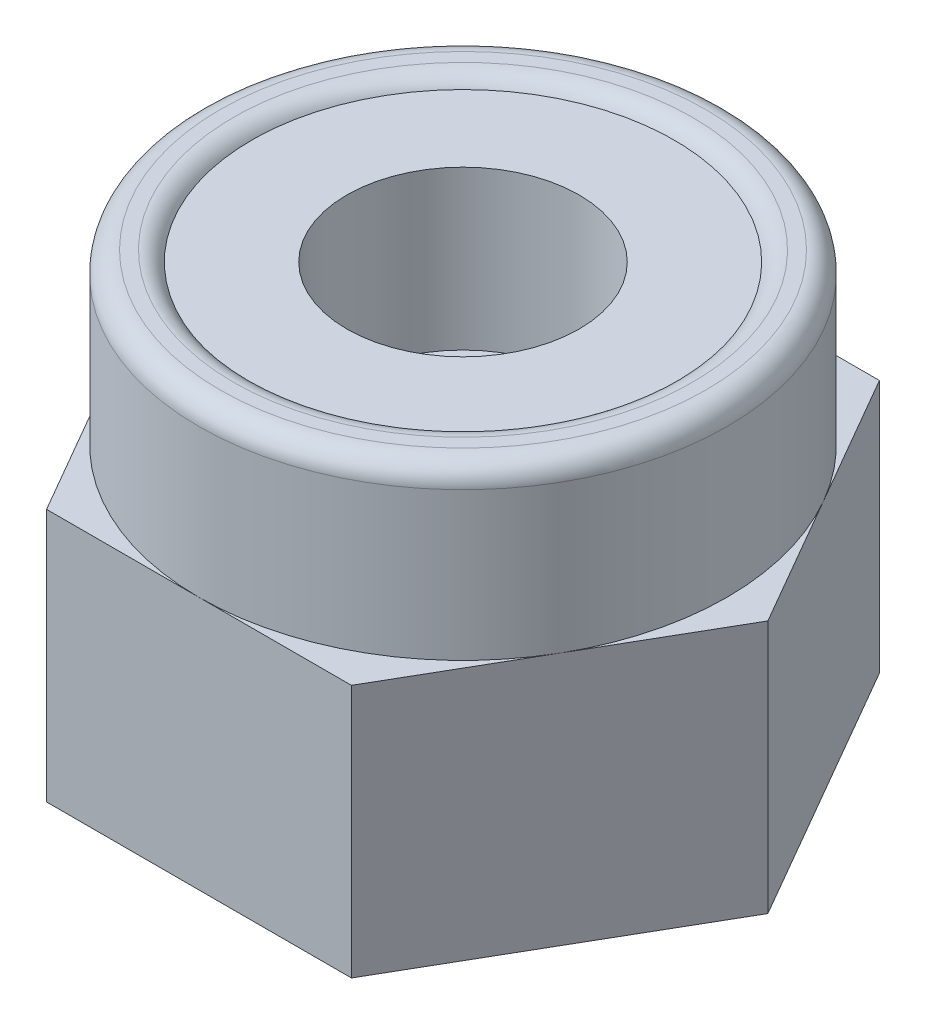
ISO-10303-21;
HEADER;
FILE_DESCRIPTION(('STEP AP214'),'2;1');
FILE_NAME('part.step','',(''),(''),'','','');
FILE_SCHEMA(('AUTOMOTIVE_DESIGN { 1 0 10303 214 1 1 1 1 }'));
ENDSEC;
DATA;
#1=APPLICATION_CONTEXT('core data for automotive mechanical design processes');
#2=APPLICATION_PROTOCOL_DEFINITION('international standard','automotive_design',2000,#1);
#3=PRODUCT_CONTEXT('',#1,'mechanical');
#4=PRODUCT('Part','Part','',(#3));
#5=PRODUCT_RELATED_PRODUCT_CATEGORY('part','',(#4));
#6=PRODUCT_DEFINITION_FORMATION('','',#4);
#7=PRODUCT_DEFINITION_CONTEXT('part definition',#1,'design');
#8=PRODUCT_DEFINITION('design','',#6,#7);
#9=PRODUCT_DEFINITION_SHAPE('','',#8);
#10=(LENGTH_UNIT() NAMED_UNIT(*) SI_UNIT(.MILLI.,.METRE.));
#11=(NAMED_UNIT(*) PLANE_ANGLE_UNIT() SI_UNIT($,.RADIAN.));
#12=(NAMED_UNIT(*) SI_UNIT($,.STERADIAN.) SOLID_ANGLE_UNIT());
#13=UNCERTAINTY_MEASURE_WITH_UNIT(LENGTH_MEASURE(1.E-05),#10,'distance_accuracy_value','');
#14=(GEOMETRIC_REPRESENTATION_CONTEXT(3) GLOBAL_UNCERTAINTY_ASSIGNED_CONTEXT((#13)) GLOBAL_UNIT_ASSIGNED_CONTEXT((#10,
#11,#12)) REPRESENTATION_CONTEXT('',''));
#15=CARTESIAN_POINT('',(0.,0.,0.));
#16=DIRECTION('',(0.,0.,1.));
#17=DIRECTION('',(1.,0.,0.));
#18=AXIS2_PLACEMENT_3D('',#15,#16,#17);
#19=CARTESIAN_POINT('',(0.,4.,0.));
#20=DIRECTION('',(0.,-1.,0.));
#21=DIRECTION('',(0.,0.,-1.));
#22=AXIS2_PLACEMENT_3D('',#19,#20,#21);
#23=CYLINDRICAL_SURFACE('',#22,1.1);
#24=CARTESIAN_POINT('',(0.,2.4,0.));
#25=DIRECTION('',(0.,1.,0.));
#26=DIRECTION('',(0.,0.,1.));
#27=AXIS2_PLACEMENT_3D('',#24,#25,#26);
#28=CIRCLE('',#27,1.1);
#29=CARTESIAN_POINT('',(0.,2.4,1.1));
#30=VERTEX_POINT('',#29);
#31=EDGE_CURVE('E145',#30,#30,#28,.T.);
#32=ORIENTED_EDGE('',*,*,#31,.F.);
#33=EDGE_LOOP('',(#32));
#34=FACE_BOUND('',#33,.T.);
#35=CARTESIAN_POINT('',(0.,3.9,0.));
#36=DIRECTION('',(0.,1.,0.));
#37=DIRECTION('',(0.,0.,1.));
#38=AXIS2_PLACEMENT_3D('',#35,#36,#37);
#39=CIRCLE('',#38,1.1);
#40=CARTESIAN_POINT('',(0.,3.9,1.1));
#41=VERTEX_POINT('',#40);
#42=EDGE_CURVE('E327',#41,#41,#39,.T.);
#43=ORIENTED_EDGE('',*,*,#42,.T.);
#44=EDGE_LOOP('',(#43));
#45=FACE_BOUND('',#44,.T.);
#46=ADVANCED_FACE('F40',(#34,#45),#23,.F.);
#47=CARTESIAN_POINT('',(-1.44337567297406,2.4,-2.5));
#48=DIRECTION('',(0.,1.,0.));
#49=DIRECTION('',(0.,0.,1.));
#50=AXIS2_PLACEMENT_3D('',#47,#48,#49);
#51=PLANE('',#50);
#52=CARTESIAN_POINT('',(0.,2.4,0.));
#53=DIRECTION('',(0.,1.,0.));
#54=DIRECTION('',(0.,0.,1.));
#55=AXIS2_PLACEMENT_3D('',#52,#53,#54);
#56=CIRCLE('',#55,2.5);
#57=CARTESIAN_POINT('',(0.,2.4,2.5));
#58=VERTEX_POINT('',#57);
#59=CARTESIAN_POINT('',(2.1650635094611,2.4,1.25));
#60=VERTEX_POINT('',#59);
#61=EDGE_CURVE('E140',#58,#60,#56,.T.);
#62=ORIENTED_EDGE('',*,*,#61,.F.);
#63=DIRECTION('',(1.,0.,0.));
#64=VECTOR('',#63,1.);
#65=CARTESIAN_POINT('',(-1.44337567297407,2.4,2.5));
#66=LINE('',#65,#64);
#67=CARTESIAN_POINT('',(1.44337567297406,2.4,2.5));
#68=VERTEX_POINT('',#67);
#69=EDGE_CURVE('E128',#58,#68,#66,.T.);
#70=ORIENTED_EDGE('',*,*,#69,.T.);
#71=DIRECTION('',(0.5,0.,-0.866025403784439));
#72=VECTOR('',#71,1.);
#73=CARTESIAN_POINT('',(1.44337567297406,2.4,2.5));
#74=LINE('',#73,#72);
#75=EDGE_CURVE('E142',#68,#60,#74,.T.);
#76=ORIENTED_EDGE('',*,*,#75,.T.);
#77=EDGE_LOOP('',(#62,#70,#76));
#78=FACE_BOUND('',#77,.T.);
#79=ADVANCED_FACE('F141',(#78),#51,.T.);
#80=CARTESIAN_POINT('',(2.1650635094611,2.4,-1.25));
#81=VERTEX_POINT('',#80);
#82=EDGE_CURVE('E63',#60,#81,#56,.T.);
#83=ORIENTED_EDGE('',*,*,#82,.F.);
#84=CARTESIAN_POINT('',(2.88675134594813,2.4,0.));
#85=VERTEX_POINT('',#84);
#86=EDGE_CURVE('E127',#60,#85,#74,.T.);
#87=ORIENTED_EDGE('',*,*,#86,.T.);
#88=DIRECTION('',(-0.5,0.,-0.866025403784439));
#89=VECTOR('',#88,1.);
#90=CARTESIAN_POINT('',(2.88675134594813,2.4,0.));
#91=LINE('',#90,#89);
#92=EDGE_CURVE('E180',#85,#81,#91,.T.);
#93=ORIENTED_EDGE('',*,*,#92,.T.);
#94=EDGE_LOOP('',(#83,#87,#93));
#95=FACE_BOUND('',#94,.T.);
#96=ADVANCED_FACE('F240',(#95),#51,.T.);
#97=CARTESIAN_POINT('',(0.,2.4,-2.5));
#98=VERTEX_POINT('',#97);
#99=EDGE_CURVE('E55',#81,#98,#56,.T.);
#100=ORIENTED_EDGE('',*,*,#99,.F.);
#101=CARTESIAN_POINT('',(1.44337567297407,2.4,-2.5));
#102=VERTEX_POINT('',#101);
#103=EDGE_CURVE('E179',#81,#102,#91,.T.);
#104=ORIENTED_EDGE('',*,*,#103,.T.);
#105=DIRECTION('',(-1.,0.,0.));
#106=VECTOR('',#105,1.);
#107=CARTESIAN_POINT('',(1.44337567297407,2.4,-2.5));
#108=LINE('',#107,#106);
#109=EDGE_CURVE('E168',#102,#98,#108,.T.);
#110=ORIENTED_EDGE('',*,*,#109,.T.);
#111=EDGE_LOOP('',(#100,#104,#110));
#112=FACE_BOUND('',#111,.T.);
#113=ADVANCED_FACE('F306',(#112),#51,.T.);
#114=CARTESIAN_POINT('',(-2.1650635094611,2.4,-1.25));
#115=VERTEX_POINT('',#114);
#116=EDGE_CURVE('E153',#98,#115,#56,.T.);
#117=ORIENTED_EDGE('',*,*,#116,.F.);
#118=CARTESIAN_POINT('',(-1.44337567297406,2.4,-2.5));
#119=VERTEX_POINT('',#118);
#120=EDGE_CURVE('E171',#98,#119,#108,.T.);
#121=ORIENTED_EDGE('',*,*,#120,.T.);
#122=DIRECTION('',(-0.5,0.,0.866025403784439));
#123=VECTOR('',#122,1.);
#124=CARTESIAN_POINT('',(-1.44337567297406,2.4,-2.5));
#125=LINE('',#124,#123);
#126=EDGE_CURVE('E172',#119,#115,#125,.T.);
#127=ORIENTED_EDGE('',*,*,#126,.T.);
#128=EDGE_LOOP('',(#117,#121,#127));
#129=FACE_BOUND('',#128,.T.);
#130=ADVANCED_FACE('F296',(#129),#51,.T.);
#131=CARTESIAN_POINT('',(-2.1650635094611,2.4,1.25));
#132=VERTEX_POINT('',#131);
#133=EDGE_CURVE('E150',#115,#132,#56,.T.);
#134=ORIENTED_EDGE('',*,*,#133,.F.);
#135=CARTESIAN_POINT('',(-2.88675134594813,2.4,0.));
#136=VERTEX_POINT('',#135);
#137=EDGE_CURVE('E170',#115,#136,#125,.T.);
#138=ORIENTED_EDGE('',*,*,#137,.T.);
#139=DIRECTION('',(0.5,0.,0.866025403784439));
#140=VECTOR('',#139,1.);
#141=CARTESIAN_POINT('',(-2.88675134594813,2.4,0.));
#142=LINE('',#141,#140);
#143=EDGE_CURVE('E138',#136,#132,#142,.T.);
#144=ORIENTED_EDGE('',*,*,#143,.T.);
#145=EDGE_LOOP('',(#134,#138,#144));
#146=FACE_BOUND('',#145,.T.);
#147=ADVANCED_FACE('F301',(#146),#51,.T.);
#148=CARTESIAN_POINT('',(0.,2.4,0.));
#149=DIRECTION('',(0.,1.,0.));
#150=DIRECTION('',(0.,0.,1.));
#151=AXIS2_PLACEMENT_3D('',#148,#149,#150);
#152=CIRCLE('',#151,1.);
#153=CARTESIAN_POINT('',(0.,2.4,1.));
#154=VERTEX_POINT('',#153);
#155=EDGE_CURVE('E161',#154,#154,#152,.T.);
#156=ORIENTED_EDGE('',*,*,#155,.F.);
#157=EDGE_LOOP('',(#156));
#158=FACE_BOUND('',#157,.T.);
#159=ORIENTED_EDGE('',*,*,#31,.T.);
#160=EDGE_LOOP('',(#159));
#161=FACE_BOUND('',#160,.T.);
#162=ADVANCED_FACE('F257',(#158,#161),#51,.T.);
#163=EDGE_CURVE('E121',#132,#58,#56,.T.);
#164=ORIENTED_EDGE('',*,*,#163,.F.);
#165=CARTESIAN_POINT('',(-1.44337567297407,2.4,2.5));
#166=VERTEX_POINT('',#165);
#167=EDGE_CURVE('E123',#132,#166,#142,.T.);
#168=ORIENTED_EDGE('',*,*,#167,.T.);
#169=EDGE_CURVE('E117',#166,#58,#66,.T.);
#170=ORIENTED_EDGE('',*,*,#169,.T.);
#171=EDGE_LOOP('',(#164,#168,#170));
#172=FACE_BOUND('',#171,.T.);
#173=ADVANCED_FACE('F119',(#172),#51,.T.);
#174=CARTESIAN_POINT('',(-1.44337567297406,0.,-2.5));
#175=DIRECTION('',(0.,1.,0.));
#176=DIRECTION('',(0.,0.,1.));
#177=AXIS2_PLACEMENT_3D('',#174,#175,#176);
#178=PLANE('',#177);
#179=DIRECTION('',(-1.,0.,0.));
#180=VECTOR('',#179,1.);
#181=CARTESIAN_POINT('',(1.44337567297407,0.,-2.5));
#182=LINE('',#181,#180);
#183=CARTESIAN_POINT('',(1.44337567297407,0.,-2.5));
#184=VERTEX_POINT('',#183);
#185=CARTESIAN_POINT('',(-1.44337567297406,0.,-2.5));
#186=VERTEX_POINT('',#185);
#187=EDGE_CURVE('E164',#184,#186,#182,.T.);
#188=ORIENTED_EDGE('',*,*,#187,.F.);
#189=DIRECTION('',(-0.5,0.,-0.866025403784439));
#190=VECTOR('',#189,1.);
#191=CARTESIAN_POINT('',(2.88675134594813,0.,0.));
#192=LINE('',#191,#190);
#193=CARTESIAN_POINT('',(2.88675134594813,0.,0.));
#194=VERTEX_POINT('',#193);
#195=EDGE_CURVE('E197',#194,#184,#192,.T.);
#196=ORIENTED_EDGE('',*,*,#195,.F.);
#197=DIRECTION('',(0.5,0.,-0.866025403784439));
#198=VECTOR('',#197,1.);
#199=CARTESIAN_POINT('',(1.44337567297406,0.,2.5));
#200=LINE('',#199,#198);
#201=CARTESIAN_POINT('',(1.44337567297406,0.,2.5));
#202=VERTEX_POINT('',#201);
#203=EDGE_CURVE('E195',#202,#194,#200,.T.);
#204=ORIENTED_EDGE('',*,*,#203,.F.);
#205=DIRECTION('',(1.,0.,0.));
#206=VECTOR('',#205,1.);
#207=CARTESIAN_POINT('',(-1.44337567297407,0.,2.5));
#208=LINE('',#207,#206);
#209=CARTESIAN_POINT('',(-1.44337567297407,0.,2.5));
#210=VERTEX_POINT('',#209);
#211=EDGE_CURVE('E193',#210,#202,#208,.T.);
#212=ORIENTED_EDGE('',*,*,#211,.F.);
#213=DIRECTION('',(0.5,0.,0.866025403784439));
#214=VECTOR('',#213,1.);
#215=CARTESIAN_POINT('',(-2.88675134594813,0.,0.));
#216=LINE('',#215,#214);
#217=CARTESIAN_POINT('',(-2.88675134594813,0.,0.));
#218=VERTEX_POINT('',#217);
#219=EDGE_CURVE('E190',#218,#210,#216,.T.);
#220=ORIENTED_EDGE('',*,*,#219,.F.);
#221=DIRECTION('',(-0.5,0.,0.866025403784439));
#222=VECTOR('',#221,1.);
#223=CARTESIAN_POINT('',(-1.44337567297406,0.,-2.5));
#224=LINE('',#223,#222);
#225=EDGE_CURVE('E187',#186,#218,#224,.T.);
#226=ORIENTED_EDGE('',*,*,#225,.F.);
#227=EDGE_LOOP('',(#188,#196,#204,#212,#220,#226));
#228=FACE_BOUND('',#227,.T.);
#229=CARTESIAN_POINT('',(0.,0.,0.));
#230=DIRECTION('',(0.,1.,0.));
#231=DIRECTION('',(0.,0.,1.));
#232=AXIS2_PLACEMENT_3D('',#229,#230,#231);
#233=CIRCLE('',#232,1.);
#234=CARTESIAN_POINT('',(0.,0.,1.));
#235=VERTEX_POINT('',#234);
#236=EDGE_CURVE('E144',#235,#235,#233,.T.);
#237=ORIENTED_EDGE('',*,*,#236,.T.);
#238=EDGE_LOOP('',(#237));
#239=FACE_BOUND('',#238,.T.);
#240=ADVANCED_FACE('F256',(#228,#239),#178,.F.);
#241=CARTESIAN_POINT('',(1.44337567297407,2.4,-2.5));
#242=DIRECTION('',(0.,0.,1.));
#243=DIRECTION('',(1.,0.,0.));
#244=AXIS2_PLACEMENT_3D('',#241,#242,#243);
#245=PLANE('',#244);
#246=ORIENTED_EDGE('',*,*,#187,.T.);
#247=DIRECTION('',(0.,-1.,0.));
#248=VECTOR('',#247,1.);
#249=CARTESIAN_POINT('',(-1.44337567297406,2.4,-2.5));
#250=LINE('',#249,#248);
#251=EDGE_CURVE('E151',#119,#186,#250,.T.);
#252=ORIENTED_EDGE('',*,*,#251,.F.);
#253=ORIENTED_EDGE('',*,*,#120,.F.);
#254=ORIENTED_EDGE('',*,*,#109,.F.);
#255=DIRECTION('',(0.,-1.,0.));
#256=VECTOR('',#255,1.);
#257=CARTESIAN_POINT('',(1.44337567297407,2.4,-2.5));
#258=LINE('',#257,#256);
#259=EDGE_CURVE('E183',#102,#184,#258,.T.);
#260=ORIENTED_EDGE('',*,*,#259,.T.);
#261=EDGE_LOOP('',(#246,#252,#253,#254,#260));
#262=FACE_BOUND('',#261,.T.);
#263=ADVANCED_FACE('F260',(#262),#245,.F.);
#264=CARTESIAN_POINT('',(-1.44337567297406,2.4,-2.5));
#265=DIRECTION('',(0.866025403784439,0.,0.5));
#266=DIRECTION('',(0.5,0.,-0.866025403784439));
#267=AXIS2_PLACEMENT_3D('',#264,#265,#266);
#268=PLANE('',#267);
#269=ORIENTED_EDGE('',*,*,#225,.T.);
#270=DIRECTION('',(0.,-1.,0.));
#271=VECTOR('',#270,1.);
#272=CARTESIAN_POINT('',(-2.88675134594813,2.4,0.));
#273=LINE('',#272,#271);
#274=EDGE_CURVE('E156',#136,#218,#273,.T.);
#275=ORIENTED_EDGE('',*,*,#274,.F.);
#276=ORIENTED_EDGE('',*,*,#137,.F.);
#277=ORIENTED_EDGE('',*,*,#126,.F.);
#278=ORIENTED_EDGE('',*,*,#251,.T.);
#279=EDGE_LOOP('',(#269,#275,#276,#277,#278));
#280=FACE_BOUND('',#279,.T.);
#281=ADVANCED_FACE('F274',(#280),#268,.F.);
#282=CARTESIAN_POINT('',(-2.88675134594813,2.4,0.));
#283=DIRECTION('',(0.866025403784439,0.,-0.5));
#284=DIRECTION('',(-0.5,0.,-0.866025403784439));
#285=AXIS2_PLACEMENT_3D('',#282,#283,#284);
#286=PLANE('',#285);
#287=ORIENTED_EDGE('',*,*,#219,.T.);
#288=DIRECTION('',(0.,-1.,0.));
#289=VECTOR('',#288,1.);
#290=CARTESIAN_POINT('',(-1.44337567297407,2.4,2.5));
#291=LINE('',#290,#289);
#292=EDGE_CURVE('E208',#166,#210,#291,.T.);
#293=ORIENTED_EDGE('',*,*,#292,.F.);
#294=ORIENTED_EDGE('',*,*,#167,.F.);
#295=ORIENTED_EDGE('',*,*,#143,.F.);
#296=ORIENTED_EDGE('',*,*,#274,.T.);
#297=EDGE_LOOP('',(#287,#293,#294,#295,#296));
#298=FACE_BOUND('',#297,.T.);
#299=ADVANCED_FACE('F271',(#298),#286,.F.);
#300=CARTESIAN_POINT('',(-1.44337567297407,2.4,2.5));
#301=DIRECTION('',(0.,0.,-1.));
#302=DIRECTION('',(-1.,0.,0.));
#303=AXIS2_PLACEMENT_3D('',#300,#301,#302);
#304=PLANE('',#303);
#305=ORIENTED_EDGE('',*,*,#211,.T.);
#306=DIRECTION('',(0.,-1.,0.));
#307=VECTOR('',#306,1.);
#308=CARTESIAN_POINT('',(1.44337567297406,2.4,2.5));
#309=LINE('',#308,#307);
#310=EDGE_CURVE('E134',#68,#202,#309,.T.);
#311=ORIENTED_EDGE('',*,*,#310,.F.);
#312=ORIENTED_EDGE('',*,*,#69,.F.);
#313=ORIENTED_EDGE('',*,*,#169,.F.);
#314=ORIENTED_EDGE('',*,*,#292,.T.);
#315=EDGE_LOOP('',(#305,#311,#312,#313,#314));
#316=FACE_BOUND('',#315,.T.);
#317=ADVANCED_FACE('F132',(#316),#304,.F.);
#318=CARTESIAN_POINT('',(1.44337567297406,2.4,2.5));
#319=DIRECTION('',(-0.866025403784439,0.,-0.5));
#320=DIRECTION('',(-0.5,0.,0.866025403784439));
#321=AXIS2_PLACEMENT_3D('',#318,#319,#320);
#322=PLANE('',#321);
#323=ORIENTED_EDGE('',*,*,#203,.T.);
#324=DIRECTION('',(0.,-1.,0.));
#325=VECTOR('',#324,1.);
#326=CARTESIAN_POINT('',(2.88675134594813,2.4,0.));
#327=LINE('',#326,#325);
#328=EDGE_CURVE('E203',#85,#194,#327,.T.);
#329=ORIENTED_EDGE('',*,*,#328,.F.);
#330=ORIENTED_EDGE('',*,*,#86,.F.);
#331=ORIENTED_EDGE('',*,*,#75,.F.);
#332=ORIENTED_EDGE('',*,*,#310,.T.);
#333=EDGE_LOOP('',(#323,#329,#330,#331,#332));
#334=FACE_BOUND('',#333,.T.);
#335=ADVANCED_FACE('F264',(#334),#322,.F.);
#336=CARTESIAN_POINT('',(2.88675134594813,2.4,0.));
#337=DIRECTION('',(-0.866025403784439,0.,0.5));
#338=DIRECTION('',(0.5,0.,0.866025403784439));
#339=AXIS2_PLACEMENT_3D('',#336,#337,#338);
#340=PLANE('',#339);
#341=ORIENTED_EDGE('',*,*,#195,.T.);
#342=ORIENTED_EDGE('',*,*,#259,.F.);
#343=ORIENTED_EDGE('',*,*,#103,.F.);
#344=ORIENTED_EDGE('',*,*,#92,.F.);
#345=ORIENTED_EDGE('',*,*,#328,.T.);
#346=EDGE_LOOP('',(#341,#342,#343,#344,#345));
#347=FACE_BOUND('',#346,.T.);
#348=ADVANCED_FACE('F252',(#347),#340,.F.);
#349=CARTESIAN_POINT('',(0.,2.4,0.));
#350=DIRECTION('',(0.,-1.,0.));
#351=DIRECTION('',(0.,0.,-1.));
#352=AXIS2_PLACEMENT_3D('',#349,#350,#351);
#353=CYLINDRICAL_SURFACE('',#352,1.);
#354=ORIENTED_EDGE('',*,*,#155,.T.);
#355=EDGE_LOOP('',(#354));
#356=FACE_BOUND('',#355,.T.);
#357=ORIENTED_EDGE('',*,*,#236,.F.);
#358=EDGE_LOOP('',(#357));
#359=FACE_BOUND('',#358,.T.);
#360=ADVANCED_FACE('F247',(#356,#359),#353,.F.);
#361=CARTESIAN_POINT('',(0.,4.,0.));
#362=DIRECTION('',(0.,1.,0.));
#363=DIRECTION('',(0.,0.,1.));
#364=AXIS2_PLACEMENT_3D('',#361,#362,#363);
#365=PLANE('',#364);
#366=CARTESIAN_POINT('',(0.,4.,0.));
#367=DIRECTION('',(0.,1.,0.));
#368=DIRECTION('',(0.,0.,1.));
#369=AXIS2_PLACEMENT_3D('',#366,#367,#368);
#370=CIRCLE('',#369,2.3);
#371=CARTESIAN_POINT('',(0.,4.,2.3));
#372=VERTEX_POINT('',#371);
#373=EDGE_CURVE('E48',#372,#372,#370,.T.);
#374=ORIENTED_EDGE('',*,*,#373,.T.);
#375=EDGE_LOOP('',(#374));
#376=FACE_BOUND('',#375,.T.);
#377=CARTESIAN_POINT('',(0.,4.,0.));
#378=DIRECTION('',(0.,1.,0.));
#379=DIRECTION('',(0.,0.,1.));
#380=AXIS2_PLACEMENT_3D('',#377,#378,#379);
#381=CIRCLE('',#380,2.17320508075689);
#382=CARTESIAN_POINT('',(0.,4.,2.17320508075689));
#383=VERTEX_POINT('',#382);
#384=EDGE_CURVE('E213',#383,#383,#381,.F.);
#385=ORIENTED_EDGE('',*,*,#384,.T.);
#386=EDGE_LOOP('',(#385));
#387=FACE_BOUND('',#386,.T.);
#388=ADVANCED_FACE('F218',(#376,#387),#365,.T.);
#389=CARTESIAN_POINT('',(0.,4.,0.));
#390=DIRECTION('',(0.,-1.,0.));
#391=DIRECTION('',(0.,0.,-1.));
#392=AXIS2_PLACEMENT_3D('',#389,#390,#391);
#393=CYLINDRICAL_SURFACE('',#392,2.5);
#394=CARTESIAN_POINT('',(0.,3.8,0.));
#395=DIRECTION('',(0.,1.,0.));
#396=DIRECTION('',(0.,0.,1.));
#397=AXIS2_PLACEMENT_3D('',#394,#395,#396);
#398=CIRCLE('',#397,2.5);
#399=CARTESIAN_POINT('',(0.,3.8,2.5));
#400=VERTEX_POINT('',#399);
#401=EDGE_CURVE('E11',#400,#400,#398,.F.);
#402=ORIENTED_EDGE('',*,*,#401,.T.);
#403=EDGE_LOOP('',(#402));
#404=FACE_BOUND('',#403,.T.);
#405=ORIENTED_EDGE('',*,*,#61,.T.);
#406=ORIENTED_EDGE('',*,*,#82,.T.);
#407=ORIENTED_EDGE('',*,*,#99,.T.);
#408=ORIENTED_EDGE('',*,*,#116,.T.);
#409=ORIENTED_EDGE('',*,*,#133,.T.);
#410=ORIENTED_EDGE('',*,*,#163,.T.);
#411=EDGE_LOOP('',(#405,#406,#407,#408,#409,#410));
#412=FACE_BOUND('',#411,.T.);
#413=ADVANCED_FACE('F148',(#404,#412),#393,.T.);
#414=CARTESIAN_POINT('',(0.,3.9,0.));
#415=DIRECTION('',(0.,1.,0.));
#416=DIRECTION('',(0.,0.,1.));
#417=AXIS2_PLACEMENT_3D('',#414,#415,#416);
#418=PLANE('',#417);
#419=ORIENTED_EDGE('',*,*,#42,.F.);
#420=EDGE_LOOP('',(#419));
#421=FACE_BOUND('',#420,.T.);
#422=CARTESIAN_POINT('',(0.,3.9,0.));
#423=DIRECTION('',(0.,1.,0.));
#424=DIRECTION('',(0.,0.,1.));
#425=AXIS2_PLACEMENT_3D('',#422,#423,#424);
#426=CIRCLE('',#425,2.);
#427=CARTESIAN_POINT('',(0.,3.9,2.));
#428=VERTEX_POINT('',#427);
#429=EDGE_CURVE('E325',#428,#428,#426,.T.);
#430=ORIENTED_EDGE('',*,*,#429,.T.);
#431=EDGE_LOOP('',(#430));
#432=FACE_BOUND('',#431,.T.);
#433=ADVANCED_FACE('F223',(#421,#432),#418,.T.);
#434=CARTESIAN_POINT('',(0.,3.8,0.));
#435=DIRECTION('',(0.,1.,0.));
#436=DIRECTION('',(0.,0.,1.));
#437=AXIS2_PLACEMENT_3D('',#434,#435,#436);
#438=TOROIDAL_SURFACE('',#437,2.3,0.2);
#439=ORIENTED_EDGE('',*,*,#401,.F.);
#440=EDGE_LOOP('',(#439));
#441=FACE_BOUND('',#440,.T.);
#442=ORIENTED_EDGE('',*,*,#373,.F.);
#443=EDGE_LOOP('',(#442));
#444=FACE_BOUND('',#443,.T.);
#445=ADVANCED_FACE('F221',(#441,#444),#438,.T.);
#446=CARTESIAN_POINT('',(0.,3.8,0.));
#447=DIRECTION('',(0.,1.,0.));
#448=DIRECTION('',(0.,0.,1.));
#449=AXIS2_PLACEMENT_3D('',#446,#447,#448);
#450=TOROIDAL_SURFACE('',#449,2.17320508075689,0.2);
#451=ORIENTED_EDGE('',*,*,#384,.F.);
#452=EDGE_LOOP('',(#451));
#453=FACE_BOUND('',#452,.T.);
#454=ORIENTED_EDGE('',*,*,#429,.F.);
#455=EDGE_LOOP('',(#454));
#456=FACE_BOUND('',#455,.T.);
#457=ADVANCED_FACE('F42',(#453,#456),#450,.T.);
#458=CLOSED_SHELL('',(#46,#79,#96,#113,#130,#147,#162,#173,#240,#263,#281,#299,#317,#335,#348,
#360,#388,#413,#433,#445,#457));
#459=MANIFOLD_SOLID_BREP('B2',#458);
#460=ADVANCED_BREP_SHAPE_REPRESENTATION('',(#18,#459),#14);
#461=SHAPE_DEFINITION_REPRESENTATION(#9,#460);
ENDSEC;
END-ISO-10303-21;
